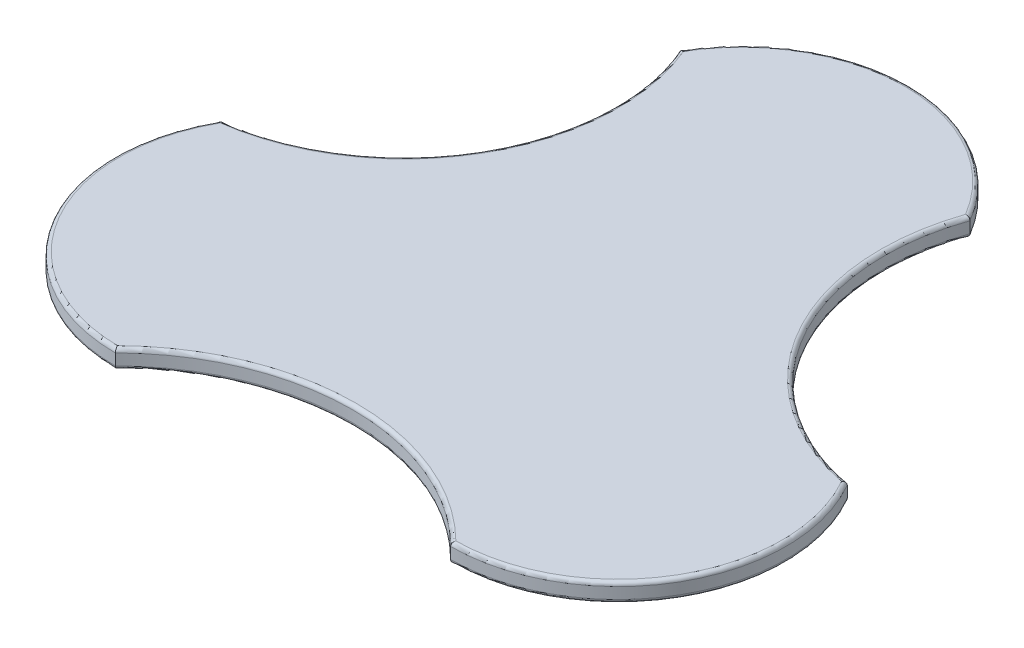
ISO-10303-21;
HEADER;
FILE_DESCRIPTION(('STEP AP214'),'2;1');
FILE_NAME('part.step','',(''),(''),'','','');
FILE_SCHEMA(('AUTOMOTIVE_DESIGN { 1 0 10303 214 1 1 1 1 }'));
ENDSEC;
DATA;
#1=APPLICATION_CONTEXT('core data for automotive mechanical design processes');
#2=APPLICATION_PROTOCOL_DEFINITION('international standard','automotive_design',2000,#1);
#3=PRODUCT_CONTEXT('',#1,'mechanical');
#4=PRODUCT('Part','Part','',(#3));
#5=PRODUCT_RELATED_PRODUCT_CATEGORY('part','',(#4));
#6=PRODUCT_DEFINITION_FORMATION('','',#4);
#7=PRODUCT_DEFINITION_CONTEXT('part definition',#1,'design');
#8=PRODUCT_DEFINITION('design','',#6,#7);
#9=PRODUCT_DEFINITION_SHAPE('','',#8);
#10=(LENGTH_UNIT() NAMED_UNIT(*) SI_UNIT(.MILLI.,.METRE.));
#11=(NAMED_UNIT(*) PLANE_ANGLE_UNIT() SI_UNIT($,.RADIAN.));
#12=(NAMED_UNIT(*) SI_UNIT($,.STERADIAN.) SOLID_ANGLE_UNIT());
#13=UNCERTAINTY_MEASURE_WITH_UNIT(LENGTH_MEASURE(1.E-05),#10,'distance_accuracy_value','');
#14=(GEOMETRIC_REPRESENTATION_CONTEXT(3) GLOBAL_UNCERTAINTY_ASSIGNED_CONTEXT((#13)) GLOBAL_UNIT_ASSIGNED_CONTEXT((#10,
#11,#12)) REPRESENTATION_CONTEXT('',''));
#15=CARTESIAN_POINT('',(0.,0.,0.));
#16=DIRECTION('',(0.,0.,1.));
#17=DIRECTION('',(1.,0.,0.));
#18=AXIS2_PLACEMENT_3D('',#15,#16,#17);
#19=CARTESIAN_POINT('',(27.9885528552039,0.5,-16.1591985251801));
#20=DIRECTION('',(0.,-1.,0.));
#21=DIRECTION('',(0.,0.,-1.));
#22=AXIS2_PLACEMENT_3D('',#19,#20,#21);
#23=CYLINDRICAL_SURFACE('',#22,11.8638935024325);
#24=DIRECTION('',(0.,-1.,0.));
#25=VECTOR('',#24,1.);
#26=CARTESIAN_POINT('',(25.7942286340599,0.5,-4.5));
#27=LINE('',#26,#25);
#28=CARTESIAN_POINT('',(25.7942286340599,0.3,-4.5));
#29=VERTEX_POINT('',#28);
#30=CARTESIAN_POINT('',(25.7942286340599,-0.3,-4.5));
#31=VERTEX_POINT('',#30);
#32=EDGE_CURVE('E267',#29,#31,#27,.T.);
#33=ORIENTED_EDGE('',*,*,#32,.T.);
#34=CARTESIAN_POINT('',(27.9885528552039,-0.3,-16.1591985251801));
#35=DIRECTION('',(0.,-1.,0.));
#36=DIRECTION('',(0.,0.,-1.));
#37=AXIS2_PLACEMENT_3D('',#34,#35,#36);
#38=CIRCLE('',#37,11.8638935024325);
#39=CARTESIAN_POINT('',(16.7942286340599,-0.3,-20.0884572681199));
#40=VERTEX_POINT('',#39);
#41=EDGE_CURVE('E197',#31,#40,#38,.T.);
#42=ORIENTED_EDGE('',*,*,#41,.T.);
#43=DIRECTION('',(0.,-1.,0.));
#44=VECTOR('',#43,1.);
#45=CARTESIAN_POINT('',(16.7942286340599,0.5,-20.0884572681199));
#46=LINE('',#45,#44);
#47=CARTESIAN_POINT('',(16.7942286340599,0.3,-20.0884572681199));
#48=VERTEX_POINT('',#47);
#49=EDGE_CURVE('E151',#48,#40,#46,.T.);
#50=ORIENTED_EDGE('',*,*,#49,.F.);
#51=CARTESIAN_POINT('',(27.9885528552039,0.3,-16.1591985251801));
#52=DIRECTION('',(0.,-1.,0.));
#53=DIRECTION('',(0.,0.,-1.));
#54=AXIS2_PLACEMENT_3D('',#51,#52,#53);
#55=CIRCLE('',#54,11.8638935024325);
#56=EDGE_CURVE('E195',#48,#29,#55,.F.);
#57=ORIENTED_EDGE('',*,*,#56,.T.);
#58=EDGE_LOOP('',(#33,#42,#50,#57));
#59=FACE_BOUND('',#58,.T.);
#60=ADVANCED_FACE('F35',(#59),#23,.F.);
#61=CARTESIAN_POINT('',(9.,0.5,-15.5884572681199));
#62=DIRECTION('',(0.,-1.,0.));
#63=DIRECTION('',(0.,0.,-1.));
#64=AXIS2_PLACEMENT_3D('',#61,#62,#63);
#65=CYLINDRICAL_SURFACE('',#64,9.);
#66=ORIENTED_EDGE('',*,*,#49,.T.);
#67=CARTESIAN_POINT('',(9.,-0.3,-15.5884572681199));
#68=DIRECTION('',(0.,-1.,0.));
#69=DIRECTION('',(0.,0.,-1.));
#70=AXIS2_PLACEMENT_3D('',#67,#68,#69);
#71=CIRCLE('',#70,9.);
#72=CARTESIAN_POINT('',(1.20577136594005,-0.3,-20.0884572681199));
#73=VERTEX_POINT('',#72);
#74=EDGE_CURVE('E150',#40,#73,#71,.F.);
#75=ORIENTED_EDGE('',*,*,#74,.T.);
#76=DIRECTION('',(0.,-1.,0.));
#77=VECTOR('',#76,1.);
#78=CARTESIAN_POINT('',(1.20577136594005,0.5,-20.0884572681199));
#79=LINE('',#78,#77);
#80=CARTESIAN_POINT('',(1.20577136594005,0.3,-20.0884572681199));
#81=VERTEX_POINT('',#80);
#82=EDGE_CURVE('E132',#81,#73,#79,.T.);
#83=ORIENTED_EDGE('',*,*,#82,.F.);
#84=CARTESIAN_POINT('',(9.,0.3,-15.5884572681199));
#85=DIRECTION('',(0.,-1.,0.));
#86=DIRECTION('',(0.,0.,-1.));
#87=AXIS2_PLACEMENT_3D('',#84,#85,#86);
#88=CIRCLE('',#87,9.);
#89=EDGE_CURVE('E147',#81,#48,#88,.T.);
#90=ORIENTED_EDGE('',*,*,#89,.T.);
#91=EDGE_LOOP('',(#66,#75,#83,#90));
#92=FACE_BOUND('',#91,.T.);
#93=ADVANCED_FACE('F145',(#92),#65,.T.);
#94=CARTESIAN_POINT('',(-9.15474131071277,0.5,-15.6777972055147));
#95=DIRECTION('',(0.,-1.,0.));
#96=DIRECTION('',(0.,0.,-1.));
#97=AXIS2_PLACEMENT_3D('',#94,#95,#96);
#98=CYLINDRICAL_SURFACE('',#97,11.2602906317264);
#99=ORIENTED_EDGE('',*,*,#82,.T.);
#100=CARTESIAN_POINT('',(-9.15474131071277,-0.3,-15.6777972055147));
#101=DIRECTION('',(0.,-1.,0.));
#102=DIRECTION('',(0.,0.,-1.));
#103=AXIS2_PLACEMENT_3D('',#100,#101,#102);
#104=CIRCLE('',#103,11.2602906317264);
#105=CARTESIAN_POINT('',(-7.79422863405994,-0.3,-4.5));
#106=VERTEX_POINT('',#105);
#107=EDGE_CURVE('E139',#73,#106,#104,.T.);
#108=ORIENTED_EDGE('',*,*,#107,.T.);
#109=DIRECTION('',(0.,-1.,0.));
#110=VECTOR('',#109,1.);
#111=CARTESIAN_POINT('',(-7.79422863405994,0.5,-4.5));
#112=LINE('',#111,#110);
#113=CARTESIAN_POINT('',(-7.79422863405994,0.3,-4.5));
#114=VERTEX_POINT('',#113);
#115=EDGE_CURVE('E134',#114,#106,#112,.T.);
#116=ORIENTED_EDGE('',*,*,#115,.F.);
#117=CARTESIAN_POINT('',(-9.15474131071277,0.3,-15.6777972055147));
#118=DIRECTION('',(0.,-1.,0.));
#119=DIRECTION('',(0.,0.,-1.));
#120=AXIS2_PLACEMENT_3D('',#117,#118,#119);
#121=CIRCLE('',#120,11.2602906317264);
#122=EDGE_CURVE('E129',#114,#81,#121,.F.);
#123=ORIENTED_EDGE('',*,*,#122,.T.);
#124=EDGE_LOOP('',(#99,#108,#116,#123));
#125=FACE_BOUND('',#124,.T.);
#126=ADVANCED_FACE('F131',(#125),#98,.F.);
#127=CARTESIAN_POINT('',(0.,0.5,0.));
#128=DIRECTION('',(0.,-1.,0.));
#129=DIRECTION('',(0.,0.,-1.));
#130=AXIS2_PLACEMENT_3D('',#127,#128,#129);
#131=CYLINDRICAL_SURFACE('',#130,9.);
#132=ORIENTED_EDGE('',*,*,#115,.T.);
#133=CARTESIAN_POINT('',(0.,-0.3,0.));
#134=DIRECTION('',(0.,-1.,0.));
#135=DIRECTION('',(0.,0.,-1.));
#136=AXIS2_PLACEMENT_3D('',#133,#134,#135);
#137=CIRCLE('',#136,9.);
#138=CARTESIAN_POINT('',(0.,-0.3,9.00000000000001));
#139=VERTEX_POINT('',#138);
#140=EDGE_CURVE('E184',#106,#139,#137,.F.);
#141=ORIENTED_EDGE('',*,*,#140,.T.);
#142=DIRECTION('',(0.,-1.,0.));
#143=VECTOR('',#142,1.);
#144=CARTESIAN_POINT('',(0.,0.5,9.00000000000001));
#145=LINE('',#144,#143);
#146=CARTESIAN_POINT('',(0.,0.3,9.00000000000001));
#147=VERTEX_POINT('',#146);
#148=EDGE_CURVE('E430',#147,#139,#145,.T.);
#149=ORIENTED_EDGE('',*,*,#148,.F.);
#150=CARTESIAN_POINT('',(0.,0.3,0.));
#151=DIRECTION('',(0.,-1.,0.));
#152=DIRECTION('',(0.,0.,-1.));
#153=AXIS2_PLACEMENT_3D('',#150,#151,#152);
#154=CIRCLE('',#153,9.);
#155=EDGE_CURVE('E182',#147,#114,#154,.T.);
#156=ORIENTED_EDGE('',*,*,#155,.T.);
#157=EDGE_LOOP('',(#132,#141,#149,#156));
#158=FACE_BOUND('',#157,.T.);
#159=ADVANCED_FACE('F321',(#158),#131,.T.);
#160=CARTESIAN_POINT('',(9.,0.5,18.));
#161=DIRECTION('',(0.,-1.,0.));
#162=DIRECTION('',(0.,0.,-1.));
#163=AXIS2_PLACEMENT_3D('',#160,#161,#162);
#164=CYLINDRICAL_SURFACE('',#163,12.7279220613579);
#165=ORIENTED_EDGE('',*,*,#148,.T.);
#166=CARTESIAN_POINT('',(9.,-0.3,18.));
#167=DIRECTION('',(0.,-1.,0.));
#168=DIRECTION('',(0.,0.,-1.));
#169=AXIS2_PLACEMENT_3D('',#166,#167,#168);
#170=CIRCLE('',#169,12.7279220613579);
#171=CARTESIAN_POINT('',(18.,-0.3,9.));
#172=VERTEX_POINT('',#171);
#173=EDGE_CURVE('E188',#139,#172,#170,.T.);
#174=ORIENTED_EDGE('',*,*,#173,.T.);
#175=DIRECTION('',(0.,-1.,0.));
#176=VECTOR('',#175,1.);
#177=CARTESIAN_POINT('',(18.,0.5,9.));
#178=LINE('',#177,#176);
#179=CARTESIAN_POINT('',(18.,0.3,9.));
#180=VERTEX_POINT('',#179);
#181=EDGE_CURVE('E427',#180,#172,#178,.T.);
#182=ORIENTED_EDGE('',*,*,#181,.F.);
#183=CARTESIAN_POINT('',(9.,0.3,18.));
#184=DIRECTION('',(0.,-1.,0.));
#185=DIRECTION('',(0.,0.,-1.));
#186=AXIS2_PLACEMENT_3D('',#183,#184,#185);
#187=CIRCLE('',#186,12.7279220613579);
#188=EDGE_CURVE('E186',#180,#147,#187,.F.);
#189=ORIENTED_EDGE('',*,*,#188,.T.);
#190=EDGE_LOOP('',(#165,#174,#182,#189));
#191=FACE_BOUND('',#190,.T.);
#192=ADVANCED_FACE('F324',(#191),#164,.F.);
#193=CARTESIAN_POINT('',(18.,0.5,0.));
#194=DIRECTION('',(0.,-1.,0.));
#195=DIRECTION('',(0.,0.,-1.));
#196=AXIS2_PLACEMENT_3D('',#193,#194,#195);
#197=CYLINDRICAL_SURFACE('',#196,9.);
#198=ORIENTED_EDGE('',*,*,#181,.T.);
#199=CARTESIAN_POINT('',(18.,-0.3,0.));
#200=DIRECTION('',(0.,-1.,0.));
#201=DIRECTION('',(0.,0.,-1.));
#202=AXIS2_PLACEMENT_3D('',#199,#200,#201);
#203=CIRCLE('',#202,9.);
#204=EDGE_CURVE('E193',#172,#31,#203,.F.);
#205=ORIENTED_EDGE('',*,*,#204,.T.);
#206=ORIENTED_EDGE('',*,*,#32,.F.);
#207=CARTESIAN_POINT('',(18.,0.3,0.));
#208=DIRECTION('',(0.,-1.,0.));
#209=DIRECTION('',(0.,0.,-1.));
#210=AXIS2_PLACEMENT_3D('',#207,#208,#209);
#211=CIRCLE('',#210,9.);
#212=EDGE_CURVE('E190',#29,#180,#211,.T.);
#213=ORIENTED_EDGE('',*,*,#212,.T.);
#214=EDGE_LOOP('',(#198,#205,#206,#213));
#215=FACE_BOUND('',#214,.T.);
#216=ADVANCED_FACE('F328',(#215),#197,.T.);
#217=CARTESIAN_POINT('',(18.494276427602,0.5,-15.87382789665));
#218=DIRECTION('',(0.,-1.,0.));
#219=DIRECTION('',(0.,0.,-1.));
#220=AXIS2_PLACEMENT_3D('',#217,#218,#219);
#221=PLANE('',#220);
#222=CARTESIAN_POINT('',(9.,0.5,18.));
#223=DIRECTION('',(0.,-1.,0.));
#224=DIRECTION('',(0.,0.,-1.));
#225=AXIS2_PLACEMENT_3D('',#222,#223,#224);
#226=CIRCLE('',#225,12.9279220613579);
#227=CARTESIAN_POINT('',(-0.0820771661430978,0.5,8.79961722683424));
#228=VERTEX_POINT('',#227);
#229=CARTESIAN_POINT('',(18.0820771661431,0.5,8.79961722683423));
#230=VERTEX_POINT('',#229);
#231=EDGE_CURVE('E48',#228,#230,#226,.T.);
#232=ORIENTED_EDGE('',*,*,#231,.T.);
#233=CARTESIAN_POINT('',(18.,0.5,0.));
#234=DIRECTION('',(0.,-1.,0.));
#235=DIRECTION('',(0.,0.,-1.));
#236=AXIS2_PLACEMENT_3D('',#233,#234,#235);
#237=CIRCLE('',#236,8.8);
#238=CARTESIAN_POINT('',(25.666111726577,0.5,-4.32096412802036));
#239=VERTEX_POINT('',#238);
#240=EDGE_CURVE('E11',#230,#239,#237,.F.);
#241=ORIENTED_EDGE('',*,*,#240,.T.);
#242=CARTESIAN_POINT('',(27.9885528552039,0.5,-16.1591985251801));
#243=DIRECTION('',(0.,-1.,0.));
#244=DIRECTION('',(0.,0.,-1.));
#245=AXIS2_PLACEMENT_3D('',#242,#243,#244);
#246=CIRCLE('',#245,12.0638935024325);
#247=CARTESIAN_POINT('',(16.5751205669954,0.5,-20.0670227075752));
#248=VERTEX_POINT('',#247);
#249=EDGE_CURVE('E199',#239,#248,#246,.T.);
#250=ORIENTED_EDGE('',*,*,#249,.T.);
#251=CARTESIAN_POINT('',(9.,0.5,-15.5884572681199));
#252=DIRECTION('',(0.,-1.,0.));
#253=DIRECTION('',(0.,0.,-1.));
#254=AXIS2_PLACEMENT_3D('',#251,#252,#253);
#255=CIRCLE('',#254,8.8);
#256=CARTESIAN_POINT('',(1.42889486025171,0.5,-20.0738075290111));
#257=VERTEX_POINT('',#256);
#258=EDGE_CURVE('E201',#248,#257,#255,.F.);
#259=ORIENTED_EDGE('',*,*,#258,.T.);
#260=CARTESIAN_POINT('',(-9.15474131071277,0.5,-15.6777972055147));
#261=DIRECTION('',(0.,-1.,0.));
#262=DIRECTION('',(0.,0.,-1.));
#263=AXIS2_PLACEMENT_3D('',#260,#261,#262);
#264=CIRCLE('',#263,11.4602906317264);
#265=CARTESIAN_POINT('',(-7.66997984067711,0.5,-4.31409425529934));
#266=VERTEX_POINT('',#265);
#267=EDGE_CURVE('E156',#257,#266,#264,.T.);
#268=ORIENTED_EDGE('',*,*,#267,.T.);
#269=CARTESIAN_POINT('',(0.,0.5,0.));
#270=DIRECTION('',(0.,-1.,0.));
#271=DIRECTION('',(0.,0.,-1.));
#272=AXIS2_PLACEMENT_3D('',#269,#270,#271);
#273=CIRCLE('',#272,8.8);
#274=EDGE_CURVE('E59',#266,#228,#273,.F.);
#275=ORIENTED_EDGE('',*,*,#274,.T.);
#276=EDGE_LOOP('',(#232,#241,#250,#259,#268,#275));
#277=FACE_BOUND('',#276,.T.);
#278=ADVANCED_FACE('F332',(#277),#221,.F.);
#279=CARTESIAN_POINT('',(18.494276427602,-0.5,-15.87382789665));
#280=DIRECTION('',(0.,-1.,0.));
#281=DIRECTION('',(0.,0.,-1.));
#282=AXIS2_PLACEMENT_3D('',#279,#280,#281);
#283=PLANE('',#282);
#284=CARTESIAN_POINT('',(-9.15474131071277,-0.5,-15.6777972055147));
#285=DIRECTION('',(0.,-1.,0.));
#286=DIRECTION('',(0.,0.,-1.));
#287=AXIS2_PLACEMENT_3D('',#284,#285,#286);
#288=CIRCLE('',#287,11.4602906317264);
#289=CARTESIAN_POINT('',(-7.66997984067711,-0.5,-4.31409425529934));
#290=VERTEX_POINT('',#289);
#291=CARTESIAN_POINT('',(1.42889486025171,-0.5,-20.0738075290111));
#292=VERTEX_POINT('',#291);
#293=EDGE_CURVE('E177',#290,#292,#288,.F.);
#294=ORIENTED_EDGE('',*,*,#293,.T.);
#295=CARTESIAN_POINT('',(9.,-0.5,-15.5884572681199));
#296=DIRECTION('',(0.,-1.,0.));
#297=DIRECTION('',(0.,0.,-1.));
#298=AXIS2_PLACEMENT_3D('',#295,#296,#297);
#299=CIRCLE('',#298,8.8);
#300=CARTESIAN_POINT('',(16.5751205669954,-0.5,-20.0670227075752));
#301=VERTEX_POINT('',#300);
#302=EDGE_CURVE('E140',#292,#301,#299,.T.);
#303=ORIENTED_EDGE('',*,*,#302,.T.);
#304=CARTESIAN_POINT('',(27.9885528552039,-0.5,-16.1591985251801));
#305=DIRECTION('',(0.,-1.,0.));
#306=DIRECTION('',(0.,0.,-1.));
#307=AXIS2_PLACEMENT_3D('',#304,#305,#306);
#308=CIRCLE('',#307,12.0638935024325);
#309=CARTESIAN_POINT('',(25.666111726577,-0.5,-4.32096412802036));
#310=VERTEX_POINT('',#309);
#311=EDGE_CURVE('E166',#301,#310,#308,.F.);
#312=ORIENTED_EDGE('',*,*,#311,.T.);
#313=CARTESIAN_POINT('',(18.,-0.5,0.));
#314=DIRECTION('',(0.,-1.,0.));
#315=DIRECTION('',(0.,0.,-1.));
#316=AXIS2_PLACEMENT_3D('',#313,#314,#315);
#317=CIRCLE('',#316,8.8);
#318=CARTESIAN_POINT('',(18.0820771661431,-0.5,8.79961722683423));
#319=VERTEX_POINT('',#318);
#320=EDGE_CURVE('E171',#310,#319,#317,.T.);
#321=ORIENTED_EDGE('',*,*,#320,.T.);
#322=CARTESIAN_POINT('',(9.,-0.5,18.));
#323=DIRECTION('',(0.,-1.,0.));
#324=DIRECTION('',(0.,0.,-1.));
#325=AXIS2_PLACEMENT_3D('',#322,#323,#324);
#326=CIRCLE('',#325,12.9279220613579);
#327=CARTESIAN_POINT('',(-0.082077166143099,-0.5,8.79961722683424));
#328=VERTEX_POINT('',#327);
#329=EDGE_CURVE('E173',#319,#328,#326,.F.);
#330=ORIENTED_EDGE('',*,*,#329,.T.);
#331=CARTESIAN_POINT('',(0.,-0.5,0.));
#332=DIRECTION('',(0.,-1.,0.));
#333=DIRECTION('',(0.,0.,-1.));
#334=AXIS2_PLACEMENT_3D('',#331,#332,#333);
#335=CIRCLE('',#334,8.8);
#336=EDGE_CURVE('E175',#328,#290,#335,.T.);
#337=ORIENTED_EDGE('',*,*,#336,.T.);
#338=EDGE_LOOP('',(#294,#303,#312,#321,#330,#337));
#339=FACE_BOUND('',#338,.T.);
#340=ADVANCED_FACE('F334',(#339),#283,.T.);
#341=CARTESIAN_POINT('',(9.,-0.3,18.));
#342=DIRECTION('',(0.,-1.,0.));
#343=DIRECTION('',(0.,0.,-1.));
#344=AXIS2_PLACEMENT_3D('',#341,#342,#343);
#345=TOROIDAL_SURFACE('',#344,12.9279220613579,0.2);
#346=CARTESIAN_POINT('',(0.,-0.3,9.));
#347=CARTESIAN_POINT('',(5.11661535917761E-06,-0.310635878587879,9.00001189113928));
#348=CARTESIAN_POINT('',(-0.000351079835712634,-0.321263943892116,8.9991524157358));
#349=CARTESIAN_POINT('',(-0.00174601865902564,-0.342179863898826,8.99578402859611));
#350=CARTESIAN_POINT('',(-0.00278284349767799,-0.352468589347916,8.99327975074966));
#351=CARTESIAN_POINT('',(-0.00549899546757077,-0.372441523535494,8.98671500436738));
#352=CARTESIAN_POINT('',(-0.00717814894070017,-0.382125894843021,8.98265495644455));
#353=CARTESIAN_POINT('',(-0.0111124144270969,-0.400652663583855,8.97313342110734));
#354=CARTESIAN_POINT('',(-0.0133677409706257,-0.409494745714976,8.96767141168795));
#355=CARTESIAN_POINT('',(-0.0184536811119478,-0.426397880563799,8.95534023501167));
#356=CARTESIAN_POINT('',(-0.0213000397900813,-0.43442598383958,8.9484325021053));
#357=CARTESIAN_POINT('',(-0.0274279596668332,-0.449217529999915,8.93354074410964));
#358=CARTESIAN_POINT('',(-0.0307096704348526,-0.455980536315,8.92555634910712));
#359=CARTESIAN_POINT('',(-0.0378629453077739,-0.468567352163551,8.90812633456178));
#360=CARTESIAN_POINT('',(-0.0417599885081762,-0.47428811839374,8.89861683938917));
#361=CARTESIAN_POINT('',(-0.0498332299035818,-0.484055602109455,8.87888234326083));
#362=CARTESIAN_POINT('',(-0.0540094975603698,-0.48810190122975,8.86865716423683));
#363=CARTESIAN_POINT('',(-0.0619482300110032,-0.494031489266332,8.84918457916513));
#364=CARTESIAN_POINT('',(-0.0656893791092672,-0.496134617777359,8.83999419154515));
#365=CARTESIAN_POINT('',(-0.0732276772488221,-0.499033260042949,8.82144617178103));
#366=CARTESIAN_POINT('',(-0.0770247080351406,-0.499831220085484,8.81208888582586));
#367=CARTESIAN_POINT('',(-0.0812365866896779,-0.499992002173891,8.80169260410587));
#368=CARTESIAN_POINT('',(-0.0816569358752083,-0.500000019184968,8.80065486142809));
#369=CARTESIAN_POINT('',(-0.0820771661430973,-0.5,8.79961722683424));
#370=B_SPLINE_CURVE_WITH_KNOTS('',3,(#346,#347,#348,#349,#350,#351,#352,#353,#354,#355,#356,
#357,#358,#359,#360,#361,#362,#363,#364,#365,#366,#367,#368,#369),.UNSPECIFIED.,.F.,.F.,(4,2,2,
2,2,2,2,2,2,2,2,4),(0.,0.0318549014184499,0.0636204410100242,0.0953773986249683,
0.127146197791378,0.159905565753765,0.192676217801531,0.227812548713786,0.262957653137885,
0.293306102987393,0.323597605032536,0.326956490365423),.UNSPECIFIED.);
#371=EDGE_CURVE('E243',#328,#139,#370,.F.);
#372=ORIENTED_EDGE('',*,*,#371,.F.);
#373=ORIENTED_EDGE('',*,*,#329,.F.);
#374=CARTESIAN_POINT('',(18.,-0.3,9.));
#375=CARTESIAN_POINT('',(17.9999948833846,-0.310635878587879,9.00001189113928));
#376=CARTESIAN_POINT('',(18.0003510798357,-0.321263943892116,8.99915241573579));
#377=CARTESIAN_POINT('',(18.001746018659,-0.342179863898826,8.9957840285961));
#378=CARTESIAN_POINT('',(18.0027828434977,-0.352468589347916,8.99327975074965));
#379=CARTESIAN_POINT('',(18.0054989954676,-0.372441523535493,8.98671500436738));
#380=CARTESIAN_POINT('',(18.0071781489407,-0.382125894843021,8.98265495644455));
#381=CARTESIAN_POINT('',(18.0111124144271,-0.400652663583855,8.97313342110733));
#382=CARTESIAN_POINT('',(18.0133677409706,-0.409494745714976,8.96767141168795));
#383=CARTESIAN_POINT('',(18.0184536811119,-0.426397880563799,8.95534023501167));
#384=CARTESIAN_POINT('',(18.0213000397901,-0.434425983839581,8.9484325021053));
#385=CARTESIAN_POINT('',(18.0274279596668,-0.449217529999915,8.93354074410964));
#386=CARTESIAN_POINT('',(18.0307096704348,-0.455980536314999,8.92555634910712));
#387=CARTESIAN_POINT('',(18.0378629453078,-0.468567352163551,8.90812633456178));
#388=CARTESIAN_POINT('',(18.0417599885082,-0.47428811839374,8.89861683938916));
#389=CARTESIAN_POINT('',(18.0498332299036,-0.484055602109455,8.87888234326082));
#390=CARTESIAN_POINT('',(18.0540094975604,-0.48810190122975,8.86865716423683));
#391=CARTESIAN_POINT('',(18.061948230011,-0.494031489266331,8.84918457916513));
#392=CARTESIAN_POINT('',(18.0656893791093,-0.496134617777359,8.83999419154514));
#393=CARTESIAN_POINT('',(18.0732276772488,-0.49903326004295,8.82144617178102));
#394=CARTESIAN_POINT('',(18.0770247080351,-0.499831220085485,8.81208888582585));
#395=CARTESIAN_POINT('',(18.0812365866897,-0.499992002173891,8.80169260410586));
#396=CARTESIAN_POINT('',(18.0816569358752,-0.500000019184968,8.80065486142808));
#397=CARTESIAN_POINT('',(18.0820771661431,-0.5,8.79961722683423));
#398=B_SPLINE_CURVE_WITH_KNOTS('',3,(#374,#375,#376,#377,#378,#379,#380,#381,#382,#383,#384,
#385,#386,#387,#388,#389,#390,#391,#392,#393,#394,#395,#396,#397),.UNSPECIFIED.,.F.,.F.,(4,2,2,
2,2,2,2,2,2,2,2,4),(0.,0.0318549014184499,0.0636204410100238,0.0953773986249687,
0.127146197791378,0.159905565753765,0.192676217801529,0.227812548713786,0.262957653137885,
0.293306102987394,0.323597605032542,0.326956490365429),.UNSPECIFIED.);
#399=EDGE_CURVE('E261',#172,#319,#398,.T.);
#400=ORIENTED_EDGE('',*,*,#399,.F.);
#401=ORIENTED_EDGE('',*,*,#173,.F.);
#402=EDGE_LOOP('',(#372,#373,#400,#401));
#403=FACE_BOUND('',#402,.T.);
#404=ADVANCED_FACE('F256',(#403),#345,.T.);
#405=CARTESIAN_POINT('',(18.,-0.3,0.));
#406=DIRECTION('',(0.,-1.,0.));
#407=DIRECTION('',(0.,0.,-1.));
#408=AXIS2_PLACEMENT_3D('',#405,#406,#407);
#409=TOROIDAL_SURFACE('',#408,8.8,0.2);
#410=ORIENTED_EDGE('',*,*,#399,.T.);
#411=ORIENTED_EDGE('',*,*,#320,.F.);
#412=CARTESIAN_POINT('',(25.7942286340599,-0.3,-4.5));
#413=CARTESIAN_POINT('',(25.794236327751,-0.310515011965607,-4.50001119045722));
#414=CARTESIAN_POINT('',(25.793701488982,-0.321021239781764,-4.49925629541868));
#415=CARTESIAN_POINT('',(25.7916077054913,-0.341690882753065,-4.49630286845715));
#416=CARTESIAN_POINT('',(25.7900520456622,-0.351855287935488,-4.4941089671117));
#417=CARTESIAN_POINT('',(25.7859777407615,-0.371582953780598,-4.48836625849327));
#418=CARTESIAN_POINT('',(25.7834595019589,-0.381146466077887,-4.48481802283573));
#419=CARTESIAN_POINT('',(25.7775587747426,-0.399446242503529,-4.47651020977101));
#420=CARTESIAN_POINT('',(25.7741758619899,-0.40818209756539,-4.47175003761012));
#421=CARTESIAN_POINT('',(25.7665229368852,-0.424941814863528,-4.46099148761408));
#422=CARTESIAN_POINT('',(25.7622248584496,-0.432927640873188,-4.45495398731226));
#423=CARTESIAN_POINT('',(25.7529609089207,-0.447662746295046,-4.44195551009358));
#424=CARTESIAN_POINT('',(25.7479948185349,-0.454411617918371,-4.43499422993189));
#425=CARTESIAN_POINT('',(25.7370778505276,-0.46710017465811,-4.41971016542866));
#426=CARTESIAN_POINT('',(25.7310789409382,-0.472919283258068,-4.41132169025719));
#427=CARTESIAN_POINT('',(25.7186188040427,-0.482903091944528,-4.39392355284722));
#428=CARTESIAN_POINT('',(25.7121573668741,-0.487067035346186,-4.38491360869815));
#429=CARTESIAN_POINT('',(25.6994617126435,-0.493430594614464,-4.36723734651673));
#430=CARTESIAN_POINT('',(25.693250334185,-0.495760162567749,-4.35860074336693));
#431=CARTESIAN_POINT('',(25.6806976797047,-0.498960048674862,-4.34117169910065));
#432=CARTESIAN_POINT('',(25.6743566774516,-0.499833173839714,-4.33237959083535));
#433=CARTESIAN_POINT('',(25.6673780019823,-0.499992783157913,-4.3227170215791));
#434=CARTESIAN_POINT('',(25.6667448541739,-0.500000016235205,-4.32184049857894));
#435=CARTESIAN_POINT('',(25.666111726577,-0.5,-4.32096412802036));
#436=B_SPLINE_CURVE_WITH_KNOTS('',3,(#412,#413,#414,#415,#416,#417,#418,#419,#420,#421,#422,
#423,#424,#425,#426,#427,#428,#429,#430,#431,#432,#433,#434,#435),.UNSPECIFIED.,.F.,.F.,(4,2,2,
2,2,2,2,2,2,2,2,4),(0.,0.0314907269430056,0.0628806137854396,0.094257266717223,
0.125649347414539,0.158196759692476,0.190754882707003,0.226130685445306,0.261522642240022,
0.294098078379413,0.326610658834537,0.329854461911905),.UNSPECIFIED.);
#437=EDGE_CURVE('E237',#31,#310,#436,.T.);
#438=ORIENTED_EDGE('',*,*,#437,.F.);
#439=ORIENTED_EDGE('',*,*,#204,.F.);
#440=EDGE_LOOP('',(#410,#411,#438,#439));
#441=FACE_BOUND('',#440,.T.);
#442=ADVANCED_FACE('F253',(#441),#409,.T.);
#443=CARTESIAN_POINT('',(0.,-0.3,0.));
#444=DIRECTION('',(0.,-1.,0.));
#445=DIRECTION('',(0.,0.,-1.));
#446=AXIS2_PLACEMENT_3D('',#443,#444,#445);
#447=TOROIDAL_SURFACE('',#446,8.8,0.2);
#448=ORIENTED_EDGE('',*,*,#371,.T.);
#449=ORIENTED_EDGE('',*,*,#140,.F.);
#450=CARTESIAN_POINT('',(-7.79422863405994,-0.3,-4.5));
#451=CARTESIAN_POINT('',(-7.7942362670303,-0.310403730792597,-4.50001192386804));
#452=CARTESIAN_POINT('',(-7.7937288010048,-0.320797780481812,-4.49924397034476));
#453=CARTESIAN_POINT('',(-7.79174463535759,-0.341240692572493,-4.4962433819261));
#454=CARTESIAN_POINT('',(-7.7902713980871,-0.351290653629031,-4.49401597926235));
#455=CARTESIAN_POINT('',(-7.78641696491193,-0.370792374843341,-4.48819199601698));
#456=CARTESIAN_POINT('',(-7.78403628062802,-0.380244468585326,-4.48459618694796));
#457=CARTESIAN_POINT('',(-7.7784636865947,-0.398334570342263,-4.47618648002866));
#458=CARTESIAN_POINT('',(-7.77527129025909,-0.406972085780114,-4.47137185155659));
#459=CARTESIAN_POINT('',(-7.76803871528252,-0.423595569740373,-4.46047528988284));
#460=CARTESIAN_POINT('',(-7.76396866621058,-0.431539185740668,-4.45434877925924));
#461=CARTESIAN_POINT('',(-7.75520132574356,-0.44621528746584,-4.44116801909664));
#462=CARTESIAN_POINT('',(-7.75050383901143,-0.452947394479318,-4.43411348064972));
#463=CARTESIAN_POINT('',(-7.74011535482652,-0.465721328883515,-4.41853381235407));
#464=CARTESIAN_POINT('',(-7.73437198972816,-0.471627125491344,-4.4099321782529));
#465=CARTESIAN_POINT('',(-7.72243921030475,-0.481802852348864,-4.39209002558863));
#466=CARTESIAN_POINT('',(-7.71624951440727,-0.486071739018506,-4.38284910387624));
#467=CARTESIAN_POINT('',(-7.70374049948894,-0.492847022077972,-4.36420551487617));
#468=CARTESIAN_POINT('',(-7.69742863843035,-0.495396027107332,-4.35481316261614));
#469=CARTESIAN_POINT('',(-7.68466252563048,-0.498887972055016,-4.33584874547455));
#470=CARTESIAN_POINT('',(-7.67820857827164,-0.499834060084414,-4.32627707027055));
#471=CARTESIAN_POINT('',(-7.67115942692461,-0.499993356365693,-4.31584031038995));
#472=CARTESIAN_POINT('',(-7.67056962923079,-0.500000013800662,-4.31496720847475));
#473=CARTESIAN_POINT('',(-7.66997984067711,-0.5,-4.31409425529934));
#474=B_SPLINE_CURVE_WITH_KNOTS('',3,(#450,#451,#452,#453,#454,#455,#456,#457,#458,#459,#460,
#461,#462,#463,#464,#465,#466,#467,#468,#469,#470,#471,#472,#473),.UNSPECIFIED.,.F.,.F.,(4,2,2,
2,2,2,2,2,2,2,2,4),(0.,0.0311554184980329,0.0621997492284533,0.0932266029192812,
0.12427209989545,0.156615887294855,0.188969767697718,0.224553977995162,0.260160836743482,
0.294849548023583,0.329470051748,0.332630952568717),.UNSPECIFIED.);
#475=EDGE_CURVE('E244',#290,#106,#474,.F.);
#476=ORIENTED_EDGE('',*,*,#475,.F.);
#477=ORIENTED_EDGE('',*,*,#336,.F.);
#478=EDGE_LOOP('',(#448,#449,#476,#477));
#479=FACE_BOUND('',#478,.T.);
#480=ADVANCED_FACE('F231',(#479),#447,.T.);
#481=CARTESIAN_POINT('',(27.9885528552039,-0.3,-16.1591985251801));
#482=DIRECTION('',(0.,-1.,0.));
#483=DIRECTION('',(0.,0.,-1.));
#484=AXIS2_PLACEMENT_3D('',#481,#482,#483);
#485=TOROIDAL_SURFACE('',#484,12.0638935024325,0.2);
#486=ORIENTED_EDGE('',*,*,#437,.T.);
#487=ORIENTED_EDGE('',*,*,#311,.F.);
#488=CARTESIAN_POINT('',(16.7942286340599,-0.3,-20.0884572681199));
#489=CARTESIAN_POINT('',(16.7942421721257,-0.310515011965606,-20.0884583358232));
#490=CARTESIAN_POINT('',(16.7933209944606,-0.321021239781764,-20.0883725993815));
#491=CARTESIAN_POINT('',(16.7897163599384,-0.341690882753064,-20.0880360431694));
#492=CARTESIAN_POINT('',(16.7870385557253,-0.351855287935487,-20.0877857529105));
#493=CARTESIAN_POINT('',(16.7800280717248,-0.371582953780597,-20.0871286556729));
#494=CARTESIAN_POINT('',(16.7756960901055,-0.381146466077886,-20.0867219147258));
#495=CARTESIAN_POINT('',(16.7655509493334,-0.399446242503528,-20.0857656415881));
#496=CARTESIAN_POINT('',(16.7597370629393,-0.408182097565388,-20.0852160392859));
#497=CARTESIAN_POINT('',(16.7465934227825,-0.424941814863526,-20.0839676867299));
#498=CARTESIAN_POINT('',(16.739215754928,-0.432927640873188,-20.0832641917682));
#499=CARTESIAN_POINT('',(16.7233267686817,-0.447662746295046,-20.0817406147461));
#500=CARTESIAN_POINT('',(16.7148150780259,-0.454411617918372,-20.0809204943954));
#501=CARTESIAN_POINT('',(16.6961202058894,-0.467100174658111,-20.0791081550204));
#502=CARTESIAN_POINT('',(16.6858561184971,-0.472919283258068,-20.0781071845067));
#503=CARTESIAN_POINT('',(16.6645588210738,-0.482903091944527,-20.0760154581255));
#504=CARTESIAN_POINT('',(16.6535252619698,-0.487067035346185,-20.0749246614671));
#505=CARTESIAN_POINT('',(16.6318693427614,-0.493430594614464,-20.0727680334765));
#506=CARTESIAN_POINT('',(16.621284135802,-0.495760162567749,-20.0717071235138));
#507=CARTESIAN_POINT('',(16.5999138134636,-0.498960048674862,-20.069550727982));
#508=CARTESIAN_POINT('',(16.5891291232264,-0.499833173839714,-20.068455313078));
#509=CARTESIAN_POINT('',(16.5772717550501,-0.499992783157913,-20.067242887465));
#510=CARTESIAN_POINT('',(16.5761960899607,-0.500000016235205,-20.0671328268787));
#511=CARTESIAN_POINT('',(16.5751205669954,-0.5,-20.0670227075752));
#512=B_SPLINE_CURVE_WITH_KNOTS('',3,(#488,#489,#490,#491,#492,#493,#494,#495,#496,#497,#498,
#499,#500,#501,#502,#503,#504,#505,#506,#507,#508,#509,#510,#511),.UNSPECIFIED.,.F.,.F.,(4,2,2,
2,2,2,2,2,2,2,2,4),(0.,0.0314907269430054,0.0628806137854385,0.0942572667172209,
0.125649347414537,0.158196759692475,0.190754882707005,0.226130685445308,0.261522642240016,
0.294098078379412,0.326610658834539,0.329854461911908),.UNSPECIFIED.);
#513=EDGE_CURVE('E213',#40,#301,#512,.T.);
#514=ORIENTED_EDGE('',*,*,#513,.F.);
#515=ORIENTED_EDGE('',*,*,#41,.F.);
#516=EDGE_LOOP('',(#486,#487,#514,#515));
#517=FACE_BOUND('',#516,.T.);
#518=ADVANCED_FACE('F226',(#517),#485,.T.);
#519=CARTESIAN_POINT('',(-9.15474131071277,-0.3,-15.6777972055147));
#520=DIRECTION('',(0.,-1.,0.));
#521=DIRECTION('',(0.,0.,-1.));
#522=AXIS2_PLACEMENT_3D('',#519,#520,#521);
#523=TOROIDAL_SURFACE('',#522,11.4602906317264,0.2);
#524=ORIENTED_EDGE('',*,*,#475,.T.);
#525=ORIENTED_EDGE('',*,*,#107,.F.);
#526=CARTESIAN_POINT('',(1.20577136594005,-0.3,-20.0884572681199));
#527=CARTESIAN_POINT('',(1.20575722308224,-0.310403730792597,-20.0884579165321));
#528=CARTESIAN_POINT('',(1.20667602335508,-0.320797780481812,-20.0884024148241));
#529=CARTESIAN_POINT('',(1.21026669197554,-0.341240692572492,-20.0881843711776));
#530=CARTESIAN_POINT('',(1.21293229790205,-0.35129065362903,-20.0880222116075));
#531=CARTESIAN_POINT('',(1.21990323193134,-0.37079237484334,-20.0875961661833));
#532=CARTESIAN_POINT('',(1.22420763607423,-0.380244468585326,-20.0873323376495));
#533=CARTESIAN_POINT('',(1.23427695292138,-0.398334570342264,-20.0867111831113));
#534=CARTESIAN_POINT('',(1.24004274165578,-0.406972085780114,-20.0863538010218));
#535=CARTESIAN_POINT('',(1.25309572836744,-0.423595569740373,-20.0855384881942));
#536=CARTESIAN_POINT('',(1.26043646674,-0.431539185740668,-20.085076977615));
#537=CARTESIAN_POINT('',(1.27623501011551,-0.44621528746584,-20.0840746181283));
#538=CARTESIAN_POINT('',(1.28469316298859,-0.452947394479318,-20.0835337445078));
#539=CARTESIAN_POINT('',(1.30337979360761,-0.465721328883515,-20.0823268874446));
#540=CARTESIAN_POINT('',(1.31370070980246,-0.471627125491344,-20.0816538044168));
#541=CARTESIAN_POINT('',(1.33511885697962,-0.481802852348864,-20.0802407906305));
#542=CARTESIAN_POINT('',(1.34621657788567,-0.486071739018506,-20.0795008175978));
#543=CARTESIAN_POINT('',(1.36861690703662,-0.492847022077972,-20.0779894874023));
#544=CARTESIAN_POINT('',(1.37990685322439,-0.495396027107332,-20.0772194315104));
#545=CARTESIAN_POINT('',(1.40271357663691,-0.498887972055016,-20.0756458620889));
#546=CARTESIAN_POINT('',(1.41422986419976,-0.499834060084413,-20.0748424173234));
#547=CARTESIAN_POINT('',(1.42679293906308,-0.499993356365693,-20.0739560531221));
#548=CARTESIAN_POINT('',(1.42784396634865,-0.500000013800662,-20.0738818242938));
#549=CARTESIAN_POINT('',(1.42889486025171,-0.5,-20.0738075290111));
#550=B_SPLINE_CURVE_WITH_KNOTS('',3,(#526,#527,#528,#529,#530,#531,#532,#533,#534,#535,#536,
#537,#538,#539,#540,#541,#542,#543,#544,#545,#546,#547,#548,#549),.UNSPECIFIED.,.F.,.F.,(4,2,2,
2,2,2,2,2,2,2,2,4),(0.,0.0311554184980327,0.0621997492284535,0.0932266029192807,
0.12427209989545,0.156615887294855,0.188969767697718,0.224553977995162,0.260160836743481,
0.294849548023583,0.329470051748,0.332630952568718),.UNSPECIFIED.);
#551=EDGE_CURVE('E206',#292,#73,#550,.F.);
#552=ORIENTED_EDGE('',*,*,#551,.F.);
#553=ORIENTED_EDGE('',*,*,#293,.F.);
#554=EDGE_LOOP('',(#524,#525,#552,#553));
#555=FACE_BOUND('',#554,.T.);
#556=ADVANCED_FACE('F219',(#555),#523,.T.);
#557=CARTESIAN_POINT('',(9.,-0.3,-15.5884572681199));
#558=DIRECTION('',(0.,-1.,0.));
#559=DIRECTION('',(0.,0.,-1.));
#560=AXIS2_PLACEMENT_3D('',#557,#558,#559);
#561=TOROIDAL_SURFACE('',#560,8.8,0.2);
#562=ORIENTED_EDGE('',*,*,#513,.T.);
#563=ORIENTED_EDGE('',*,*,#302,.F.);
#564=ORIENTED_EDGE('',*,*,#551,.T.);
#565=ORIENTED_EDGE('',*,*,#74,.F.);
#566=EDGE_LOOP('',(#562,#563,#564,#565));
#567=FACE_BOUND('',#566,.T.);
#568=ADVANCED_FACE('F222',(#567),#561,.T.);
#569=CARTESIAN_POINT('',(-9.15474131071277,0.3,-15.6777972055147));
#570=DIRECTION('',(0.,-1.,0.));
#571=DIRECTION('',(0.,0.,-1.));
#572=AXIS2_PLACEMENT_3D('',#569,#570,#571);
#573=TOROIDAL_SURFACE('',#572,11.4602906317264,0.2);
#574=CARTESIAN_POINT('',(1.20577136594005,0.3,-20.0884572681199));
#575=CARTESIAN_POINT('',(1.20575722308224,0.310403730792597,-20.0884579165321));
#576=CARTESIAN_POINT('',(1.20667602335508,0.320797780481812,-20.0884024148241));
#577=CARTESIAN_POINT('',(1.21026669197554,0.341240692572492,-20.0881843711776));
#578=CARTESIAN_POINT('',(1.21293229790205,0.35129065362903,-20.0880222116075));
#579=CARTESIAN_POINT('',(1.21990323193134,0.37079237484334,-20.0875961661833));
#580=CARTESIAN_POINT('',(1.22420763607423,0.380244468585326,-20.0873323376495));
#581=CARTESIAN_POINT('',(1.23427695292138,0.398334570342264,-20.0867111831113));
#582=CARTESIAN_POINT('',(1.24004274165578,0.406972085780114,-20.0863538010218));
#583=CARTESIAN_POINT('',(1.25309572836744,0.423595569740373,-20.0855384881942));
#584=CARTESIAN_POINT('',(1.26043646674,0.431539185740668,-20.085076977615));
#585=CARTESIAN_POINT('',(1.27623501011551,0.44621528746584,-20.0840746181283));
#586=CARTESIAN_POINT('',(1.28469316298859,0.452947394479318,-20.0835337445078));
#587=CARTESIAN_POINT('',(1.30337979360761,0.465721328883515,-20.0823268874446));
#588=CARTESIAN_POINT('',(1.31370070980246,0.471627125491344,-20.0816538044168));
#589=CARTESIAN_POINT('',(1.33511885697962,0.481802852348864,-20.0802407906305));
#590=CARTESIAN_POINT('',(1.34621657788567,0.486071739018506,-20.0795008175978));
#591=CARTESIAN_POINT('',(1.36861690703662,0.492847022077972,-20.0779894874023));
#592=CARTESIAN_POINT('',(1.37990685322439,0.495396027107332,-20.0772194315104));
#593=CARTESIAN_POINT('',(1.40271357663691,0.498887972055016,-20.0756458620889));
#594=CARTESIAN_POINT('',(1.41422986419976,0.499834060084413,-20.0748424173234));
#595=CARTESIAN_POINT('',(1.42679293906308,0.499993356365693,-20.0739560531221));
#596=CARTESIAN_POINT('',(1.42784396634865,0.500000013800662,-20.0738818242938));
#597=CARTESIAN_POINT('',(1.42889486025171,0.5,-20.0738075290111));
#598=B_SPLINE_CURVE_WITH_KNOTS('',3,(#574,#575,#576,#577,#578,#579,#580,#581,#582,#583,#584,
#585,#586,#587,#588,#589,#590,#591,#592,#593,#594,#595,#596,#597),.UNSPECIFIED.,.F.,.F.,(4,2,2,
2,2,2,2,2,2,2,2,4),(0.,0.0311554184980327,0.0621997492284535,0.0932266029192807,
0.12427209989545,0.156615887294855,0.188969767697718,0.224553977995162,0.260160836743481,
0.294849548023582,0.329470051748,0.332630952568717),.UNSPECIFIED.);
#599=EDGE_CURVE('E155',#81,#257,#598,.T.);
#600=ORIENTED_EDGE('',*,*,#599,.F.);
#601=ORIENTED_EDGE('',*,*,#122,.F.);
#602=CARTESIAN_POINT('',(-7.79422863405994,0.3,-4.5));
#603=CARTESIAN_POINT('',(-7.7942362670303,0.310403730792597,-4.50001192386804));
#604=CARTESIAN_POINT('',(-7.7937288010048,0.320797780481812,-4.49924397034476));
#605=CARTESIAN_POINT('',(-7.79174463535759,0.341240692572493,-4.4962433819261));
#606=CARTESIAN_POINT('',(-7.7902713980871,0.351290653629031,-4.49401597926235));
#607=CARTESIAN_POINT('',(-7.78641696491193,0.370792374843341,-4.48819199601698));
#608=CARTESIAN_POINT('',(-7.78403628062802,0.380244468585326,-4.48459618694796));
#609=CARTESIAN_POINT('',(-7.7784636865947,0.398334570342263,-4.47618648002866));
#610=CARTESIAN_POINT('',(-7.77527129025909,0.406972085780114,-4.47137185155659));
#611=CARTESIAN_POINT('',(-7.76803871528252,0.423595569740373,-4.46047528988284));
#612=CARTESIAN_POINT('',(-7.76396866621058,0.431539185740668,-4.45434877925924));
#613=CARTESIAN_POINT('',(-7.75520132574356,0.44621528746584,-4.44116801909664));
#614=CARTESIAN_POINT('',(-7.75050383901143,0.452947394479318,-4.43411348064972));
#615=CARTESIAN_POINT('',(-7.74011535482652,0.465721328883515,-4.41853381235407));
#616=CARTESIAN_POINT('',(-7.73437198972816,0.471627125491344,-4.4099321782529));
#617=CARTESIAN_POINT('',(-7.72243921030475,0.481802852348864,-4.39209002558863));
#618=CARTESIAN_POINT('',(-7.71624951440727,0.486071739018506,-4.38284910387624));
#619=CARTESIAN_POINT('',(-7.70374049948894,0.492847022077972,-4.36420551487617));
#620=CARTESIAN_POINT('',(-7.69742863843035,0.495396027107332,-4.35481316261614));
#621=CARTESIAN_POINT('',(-7.68466252563048,0.498887972055016,-4.33584874547455));
#622=CARTESIAN_POINT('',(-7.67820857827164,0.499834060084414,-4.32627707027055));
#623=CARTESIAN_POINT('',(-7.67115942692461,0.499993356365693,-4.31584031038995));
#624=CARTESIAN_POINT('',(-7.67056962923079,0.500000013800662,-4.31496720847475));
#625=CARTESIAN_POINT('',(-7.66997984067711,0.5,-4.31409425529934));
#626=B_SPLINE_CURVE_WITH_KNOTS('',3,(#602,#603,#604,#605,#606,#607,#608,#609,#610,#611,#612,
#613,#614,#615,#616,#617,#618,#619,#620,#621,#622,#623,#624,#625),.UNSPECIFIED.,.F.,.F.,(4,2,2,
2,2,2,2,2,2,2,2,4),(0.,0.0311554184980329,0.0621997492284533,0.0932266029192812,
0.12427209989545,0.156615887294855,0.188969767697718,0.224553977995162,0.260160836743482,
0.294849548023583,0.329470051748,0.332630952568717),.UNSPECIFIED.);
#627=EDGE_CURVE('E40',#266,#114,#626,.F.);
#628=ORIENTED_EDGE('',*,*,#627,.F.);
#629=ORIENTED_EDGE('',*,*,#267,.F.);
#630=EDGE_LOOP('',(#600,#601,#628,#629));
#631=FACE_BOUND('',#630,.T.);
#632=ADVANCED_FACE('F37',(#631),#573,.T.);
#633=CARTESIAN_POINT('',(0.,0.3,0.));
#634=DIRECTION('',(0.,-1.,0.));
#635=DIRECTION('',(0.,0.,-1.));
#636=AXIS2_PLACEMENT_3D('',#633,#634,#635);
#637=TOROIDAL_SURFACE('',#636,8.8,0.2);
#638=ORIENTED_EDGE('',*,*,#627,.T.);
#639=ORIENTED_EDGE('',*,*,#155,.F.);
#640=CARTESIAN_POINT('',(0.,0.3,9.));
#641=CARTESIAN_POINT('',(5.11661535913459E-06,0.310635878587879,9.00001189113928));
#642=CARTESIAN_POINT('',(-0.00035107983571272,0.321263943892116,8.9991524157358));
#643=CARTESIAN_POINT('',(-0.00174601865902575,0.342179863898826,8.99578402859611));
#644=CARTESIAN_POINT('',(-0.00278284349767808,0.352468589347916,8.99327975074966));
#645=CARTESIAN_POINT('',(-0.00549899546757068,0.372441523535494,8.98671500436738));
#646=CARTESIAN_POINT('',(-0.00717814894069993,0.382125894843021,8.98265495644455));
#647=CARTESIAN_POINT('',(-0.011112414427097,0.400652663583855,8.97313342110734));
#648=CARTESIAN_POINT('',(-0.0133677409706262,0.409494745714976,8.96767141168796));
#649=CARTESIAN_POINT('',(-0.0184536811119473,0.426397880563799,8.95534023501167));
#650=CARTESIAN_POINT('',(-0.0213000397900792,0.434425983839581,8.9484325021053));
#651=CARTESIAN_POINT('',(-0.0274279596668312,0.449217529999915,8.93354074410964));
#652=CARTESIAN_POINT('',(-0.0307096704348523,0.455980536315,8.92555634910712));
#653=CARTESIAN_POINT('',(-0.0378629453077741,0.468567352163551,8.90812633456178));
#654=CARTESIAN_POINT('',(-0.0417599885081751,0.47428811839374,8.89861683938917));
#655=CARTESIAN_POINT('',(-0.0498332299035806,0.484055602109455,8.87888234326083));
#656=CARTESIAN_POINT('',(-0.0540094975603697,0.48810190122975,8.86865716423683));
#657=CARTESIAN_POINT('',(-0.061948230011003,0.494031489266331,8.84918457916513));
#658=CARTESIAN_POINT('',(-0.065689379109266,0.496134617777359,8.83999419154515));
#659=CARTESIAN_POINT('',(-0.073227677248823,0.499033260042949,8.82144617178103));
#660=CARTESIAN_POINT('',(-0.0770247080351446,0.499831220085484,8.81208888582587));
#661=CARTESIAN_POINT('',(-0.081236586689679,0.499992002173891,8.80169260410586));
#662=CARTESIAN_POINT('',(-0.0816569358752091,0.500000019184968,8.80065486142809));
#663=CARTESIAN_POINT('',(-0.0820771661430978,0.5,8.79961722683424));
#664=B_SPLINE_CURVE_WITH_KNOTS('',3,(#640,#641,#642,#643,#644,#645,#646,#647,#648,#649,#650,
#651,#652,#653,#654,#655,#656,#657,#658,#659,#660,#661,#662,#663),.UNSPECIFIED.,.F.,.F.,(4,2,2,
2,2,2,2,2,2,2,2,4),(0.,0.0318549014184499,0.0636204410100241,0.0953773986249683,
0.127146197791378,0.159905565753765,0.192676217801531,0.227812548713786,0.262957653137885,
0.293306102987391,0.323597605032537,0.326956490365425),.UNSPECIFIED.);
#665=EDGE_CURVE('E159',#228,#147,#664,.F.);
#666=ORIENTED_EDGE('',*,*,#665,.F.);
#667=ORIENTED_EDGE('',*,*,#274,.F.);
#668=EDGE_LOOP('',(#638,#639,#666,#667));
#669=FACE_BOUND('',#668,.T.);
#670=ADVANCED_FACE('F299',(#669),#637,.T.);
#671=CARTESIAN_POINT('',(9.,0.3,-15.5884572681199));
#672=DIRECTION('',(0.,-1.,0.));
#673=DIRECTION('',(0.,0.,-1.));
#674=AXIS2_PLACEMENT_3D('',#671,#672,#673);
#675=TOROIDAL_SURFACE('',#674,8.8,0.2);
#676=ORIENTED_EDGE('',*,*,#599,.T.);
#677=ORIENTED_EDGE('',*,*,#258,.F.);
#678=CARTESIAN_POINT('',(16.7942286340599,0.3,-20.0884572681199));
#679=CARTESIAN_POINT('',(16.7942421721257,0.310515011965606,-20.0884583358232));
#680=CARTESIAN_POINT('',(16.7933209944606,0.321021239781764,-20.0883725993815));
#681=CARTESIAN_POINT('',(16.7897163599384,0.341690882753064,-20.0880360431694));
#682=CARTESIAN_POINT('',(16.7870385557253,0.351855287935487,-20.0877857529105));
#683=CARTESIAN_POINT('',(16.7800280717248,0.371582953780597,-20.0871286556729));
#684=CARTESIAN_POINT('',(16.7756960901055,0.381146466077886,-20.0867219147258));
#685=CARTESIAN_POINT('',(16.7655509493334,0.399446242503528,-20.0857656415881));
#686=CARTESIAN_POINT('',(16.7597370629393,0.408182097565388,-20.0852160392859));
#687=CARTESIAN_POINT('',(16.7465934227825,0.424941814863526,-20.0839676867299));
#688=CARTESIAN_POINT('',(16.739215754928,0.432927640873188,-20.0832641917682));
#689=CARTESIAN_POINT('',(16.7233267686817,0.447662746295046,-20.0817406147461));
#690=CARTESIAN_POINT('',(16.7148150780259,0.454411617918372,-20.0809204943954));
#691=CARTESIAN_POINT('',(16.6961202058894,0.467100174658111,-20.0791081550204));
#692=CARTESIAN_POINT('',(16.6858561184971,0.472919283258068,-20.0781071845067));
#693=CARTESIAN_POINT('',(16.6645588210738,0.482903091944527,-20.0760154581255));
#694=CARTESIAN_POINT('',(16.6535252619698,0.487067035346185,-20.0749246614671));
#695=CARTESIAN_POINT('',(16.6318693427614,0.493430594614464,-20.0727680334765));
#696=CARTESIAN_POINT('',(16.621284135802,0.495760162567749,-20.0717071235138));
#697=CARTESIAN_POINT('',(16.5999138134636,0.498960048674862,-20.069550727982));
#698=CARTESIAN_POINT('',(16.5891291232264,0.499833173839714,-20.068455313078));
#699=CARTESIAN_POINT('',(16.5772717550501,0.499992783157913,-20.067242887465));
#700=CARTESIAN_POINT('',(16.5761960899607,0.500000016235205,-20.0671328268787));
#701=CARTESIAN_POINT('',(16.5751205669954,0.5,-20.0670227075752));
#702=B_SPLINE_CURVE_WITH_KNOTS('',3,(#678,#679,#680,#681,#682,#683,#684,#685,#686,#687,#688,
#689,#690,#691,#692,#693,#694,#695,#696,#697,#698,#699,#700,#701),.UNSPECIFIED.,.F.,.F.,(4,2,2,
2,2,2,2,2,2,2,2,4),(0.,0.0314907269430054,0.0628806137854385,0.0942572667172209,
0.125649347414537,0.158196759692475,0.190754882707005,0.226130685445308,0.261522642240016,
0.294098078379412,0.326610658834539,0.329854461911908),.UNSPECIFIED.);
#703=EDGE_CURVE('E163',#48,#248,#702,.T.);
#704=ORIENTED_EDGE('',*,*,#703,.F.);
#705=ORIENTED_EDGE('',*,*,#89,.F.);
#706=EDGE_LOOP('',(#676,#677,#704,#705));
#707=FACE_BOUND('',#706,.T.);
#708=ADVANCED_FACE('F161',(#707),#675,.T.);
#709=CARTESIAN_POINT('',(9.,0.3,18.));
#710=DIRECTION('',(0.,-1.,0.));
#711=DIRECTION('',(0.,0.,-1.));
#712=AXIS2_PLACEMENT_3D('',#709,#710,#711);
#713=TOROIDAL_SURFACE('',#712,12.9279220613579,0.2);
#714=ORIENTED_EDGE('',*,*,#665,.T.);
#715=ORIENTED_EDGE('',*,*,#188,.F.);
#716=CARTESIAN_POINT('',(18.,0.3,9.));
#717=CARTESIAN_POINT('',(17.9999948833846,0.310635878587879,9.00001189113928));
#718=CARTESIAN_POINT('',(18.0003510798357,0.321263943892116,8.99915241573579));
#719=CARTESIAN_POINT('',(18.001746018659,0.342179863898826,8.9957840285961));
#720=CARTESIAN_POINT('',(18.0027828434977,0.352468589347916,8.99327975074965));
#721=CARTESIAN_POINT('',(18.0054989954676,0.372441523535493,8.98671500436738));
#722=CARTESIAN_POINT('',(18.0071781489407,0.382125894843021,8.98265495644455));
#723=CARTESIAN_POINT('',(18.0111124144271,0.400652663583855,8.97313342110733));
#724=CARTESIAN_POINT('',(18.0133677409706,0.409494745714976,8.96767141168795));
#725=CARTESIAN_POINT('',(18.0184536811119,0.426397880563799,8.95534023501167));
#726=CARTESIAN_POINT('',(18.0213000397901,0.434425983839581,8.9484325021053));
#727=CARTESIAN_POINT('',(18.0274279596668,0.449217529999915,8.93354074410964));
#728=CARTESIAN_POINT('',(18.0307096704348,0.455980536314999,8.92555634910712));
#729=CARTESIAN_POINT('',(18.0378629453078,0.468567352163551,8.90812633456178));
#730=CARTESIAN_POINT('',(18.0417599885082,0.47428811839374,8.89861683938916));
#731=CARTESIAN_POINT('',(18.0498332299036,0.484055602109455,8.87888234326082));
#732=CARTESIAN_POINT('',(18.0540094975604,0.48810190122975,8.86865716423683));
#733=CARTESIAN_POINT('',(18.061948230011,0.494031489266331,8.84918457916513));
#734=CARTESIAN_POINT('',(18.0656893791093,0.496134617777359,8.83999419154514));
#735=CARTESIAN_POINT('',(18.0732276772488,0.49903326004295,8.82144617178102));
#736=CARTESIAN_POINT('',(18.0770247080351,0.499831220085485,8.81208888582585));
#737=CARTESIAN_POINT('',(18.0812365866897,0.499992002173891,8.80169260410586));
#738=CARTESIAN_POINT('',(18.0816569358752,0.500000019184968,8.80065486142808));
#739=CARTESIAN_POINT('',(18.0820771661431,0.5,8.79961722683423));
#740=B_SPLINE_CURVE_WITH_KNOTS('',3,(#716,#717,#718,#719,#720,#721,#722,#723,#724,#725,#726,
#727,#728,#729,#730,#731,#732,#733,#734,#735,#736,#737,#738,#739),.UNSPECIFIED.,.F.,.F.,(4,2,2,
2,2,2,2,2,2,2,2,4),(0.,0.0318549014184499,0.0636204410100238,0.0953773986249687,
0.127146197791378,0.159905565753765,0.192676217801529,0.227812548713786,0.262957653137885,
0.293306102987394,0.323597605032542,0.326956490365429),.UNSPECIFIED.);
#741=EDGE_CURVE('E274',#230,#180,#740,.F.);
#742=ORIENTED_EDGE('',*,*,#741,.F.);
#743=ORIENTED_EDGE('',*,*,#231,.F.);
#744=EDGE_LOOP('',(#714,#715,#742,#743));
#745=FACE_BOUND('',#744,.T.);
#746=ADVANCED_FACE('F285',(#745),#713,.T.);
#747=CARTESIAN_POINT('',(27.9885528552039,0.3,-16.1591985251801));
#748=DIRECTION('',(0.,-1.,0.));
#749=DIRECTION('',(0.,0.,-1.));
#750=AXIS2_PLACEMENT_3D('',#747,#748,#749);
#751=TOROIDAL_SURFACE('',#750,12.0638935024325,0.2);
#752=ORIENTED_EDGE('',*,*,#703,.T.);
#753=ORIENTED_EDGE('',*,*,#249,.F.);
#754=CARTESIAN_POINT('',(25.7942286340599,0.3,-4.5));
#755=CARTESIAN_POINT('',(25.794236327751,0.310515011965607,-4.50001119045722));
#756=CARTESIAN_POINT('',(25.793701488982,0.321021239781764,-4.49925629541868));
#757=CARTESIAN_POINT('',(25.7916077054913,0.341690882753065,-4.49630286845715));
#758=CARTESIAN_POINT('',(25.7900520456622,0.351855287935488,-4.4941089671117));
#759=CARTESIAN_POINT('',(25.7859777407615,0.371582953780598,-4.48836625849327));
#760=CARTESIAN_POINT('',(25.7834595019589,0.381146466077887,-4.48481802283573));
#761=CARTESIAN_POINT('',(25.7775587747426,0.399446242503529,-4.47651020977101));
#762=CARTESIAN_POINT('',(25.7741758619899,0.40818209756539,-4.47175003761012));
#763=CARTESIAN_POINT('',(25.7665229368852,0.424941814863528,-4.46099148761408));
#764=CARTESIAN_POINT('',(25.7622248584496,0.432927640873188,-4.45495398731226));
#765=CARTESIAN_POINT('',(25.7529609089207,0.447662746295046,-4.44195551009358));
#766=CARTESIAN_POINT('',(25.7479948185349,0.454411617918371,-4.43499422993189));
#767=CARTESIAN_POINT('',(25.7370778505276,0.46710017465811,-4.41971016542866));
#768=CARTESIAN_POINT('',(25.7310789409382,0.472919283258068,-4.41132169025719));
#769=CARTESIAN_POINT('',(25.7186188040427,0.482903091944528,-4.39392355284722));
#770=CARTESIAN_POINT('',(25.7121573668741,0.487067035346186,-4.38491360869815));
#771=CARTESIAN_POINT('',(25.6994617126435,0.493430594614464,-4.36723734651673));
#772=CARTESIAN_POINT('',(25.693250334185,0.495760162567749,-4.35860074336693));
#773=CARTESIAN_POINT('',(25.6806976797047,0.498960048674862,-4.34117169910065));
#774=CARTESIAN_POINT('',(25.6743566774516,0.499833173839714,-4.33237959083535));
#775=CARTESIAN_POINT('',(25.6673780019823,0.499992783157913,-4.3227170215791));
#776=CARTESIAN_POINT('',(25.6667448541739,0.500000016235205,-4.32184049857894));
#777=CARTESIAN_POINT('',(25.666111726577,0.5,-4.32096412802036));
#778=B_SPLINE_CURVE_WITH_KNOTS('',3,(#754,#755,#756,#757,#758,#759,#760,#761,#762,#763,#764,
#765,#766,#767,#768,#769,#770,#771,#772,#773,#774,#775,#776,#777),.UNSPECIFIED.,.F.,.F.,(4,2,2,
2,2,2,2,2,2,2,2,4),(0.,0.0314907269430056,0.0628806137854396,0.094257266717223,
0.125649347414539,0.158196759692476,0.190754882707003,0.226130685445306,0.261522642240022,
0.294098078379413,0.326610658834537,0.329854461911905),.UNSPECIFIED.);
#779=EDGE_CURVE('E268',#29,#239,#778,.T.);
#780=ORIENTED_EDGE('',*,*,#779,.F.);
#781=ORIENTED_EDGE('',*,*,#56,.F.);
#782=EDGE_LOOP('',(#752,#753,#780,#781));
#783=FACE_BOUND('',#782,.T.);
#784=ADVANCED_FACE('F282',(#783),#751,.T.);
#785=CARTESIAN_POINT('',(18.,0.3,0.));
#786=DIRECTION('',(0.,-1.,0.));
#787=DIRECTION('',(0.,0.,-1.));
#788=AXIS2_PLACEMENT_3D('',#785,#786,#787);
#789=TOROIDAL_SURFACE('',#788,8.8,0.2);
#790=ORIENTED_EDGE('',*,*,#741,.T.);
#791=ORIENTED_EDGE('',*,*,#212,.F.);
#792=ORIENTED_EDGE('',*,*,#779,.T.);
#793=ORIENTED_EDGE('',*,*,#240,.F.);
#794=EDGE_LOOP('',(#790,#791,#792,#793));
#795=FACE_BOUND('',#794,.T.);
#796=ADVANCED_FACE('F280',(#795),#789,.T.);
#797=CLOSED_SHELL('',(#60,#93,#126,#159,#192,#216,#278,#340,#404,#442,#480,#518,#556,#568,#632,
#670,#708,#746,#784,#796));
#798=MANIFOLD_SOLID_BREP('B2',#797);
#799=ADVANCED_BREP_SHAPE_REPRESENTATION('',(#18,#798),#14);
#800=SHAPE_DEFINITION_REPRESENTATION(#9,#799);
ENDSEC;
END-ISO-10303-21;
